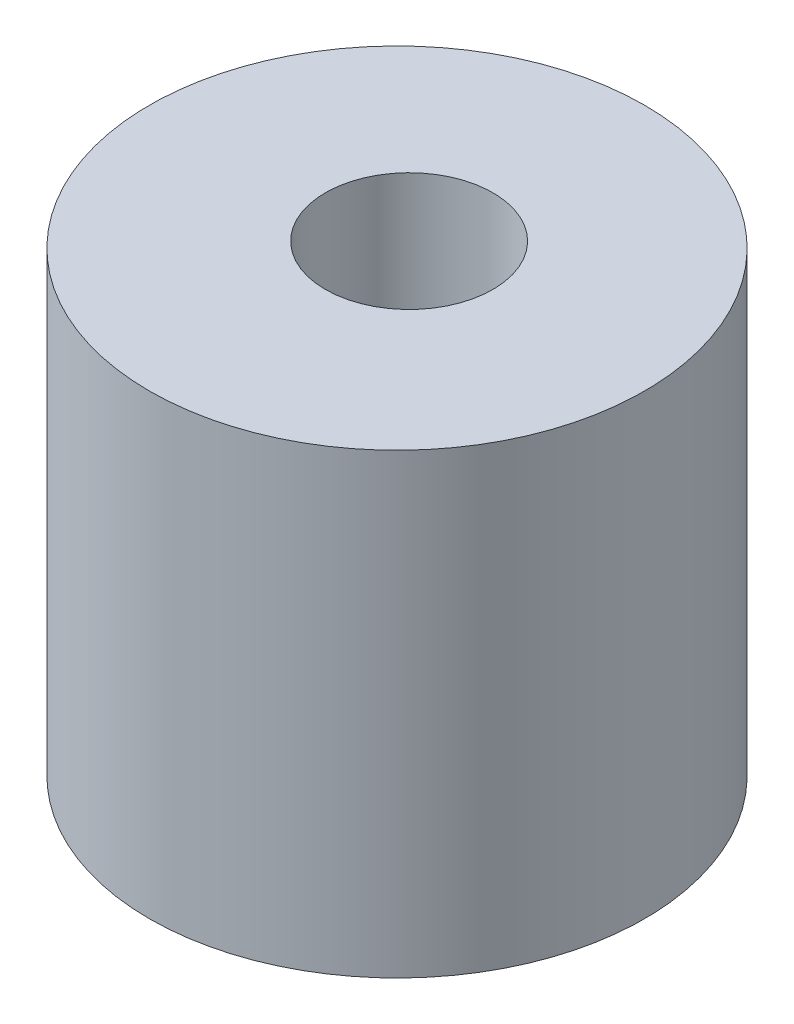
ISO-10303-21;
HEADER;
FILE_DESCRIPTION(('STEP AP214'),'2;1');
FILE_NAME('part.step','',(''),(''),'','','');
FILE_SCHEMA(('AUTOMOTIVE_DESIGN { 1 0 10303 214 1 1 1 1 }'));
ENDSEC;
DATA;
#1=APPLICATION_CONTEXT('core data for automotive mechanical design processes');
#2=APPLICATION_PROTOCOL_DEFINITION('international standard','automotive_design',2000,#1);
#3=PRODUCT_CONTEXT('',#1,'mechanical');
#4=PRODUCT('Part','Part','',(#3));
#5=PRODUCT_RELATED_PRODUCT_CATEGORY('part','',(#4));
#6=PRODUCT_DEFINITION_FORMATION('','',#4);
#7=PRODUCT_DEFINITION_CONTEXT('part definition',#1,'design');
#8=PRODUCT_DEFINITION('design','',#6,#7);
#9=PRODUCT_DEFINITION_SHAPE('','',#8);
#10=(LENGTH_UNIT() NAMED_UNIT(*) SI_UNIT(.MILLI.,.METRE.));
#11=(NAMED_UNIT(*) PLANE_ANGLE_UNIT() SI_UNIT($,.RADIAN.));
#12=(NAMED_UNIT(*) SI_UNIT($,.STERADIAN.) SOLID_ANGLE_UNIT());
#13=UNCERTAINTY_MEASURE_WITH_UNIT(LENGTH_MEASURE(1.E-05),#10,'distance_accuracy_value','');
#14=(GEOMETRIC_REPRESENTATION_CONTEXT(3) GLOBAL_UNCERTAINTY_ASSIGNED_CONTEXT((#13)) GLOBAL_UNIT_ASSIGNED_CONTEXT((#10,
#11,#12)) REPRESENTATION_CONTEXT('',''));
#15=CARTESIAN_POINT('',(0.,0.,0.));
#16=DIRECTION('',(0.,0.,1.));
#17=DIRECTION('',(1.,0.,0.));
#18=AXIS2_PLACEMENT_3D('',#15,#16,#17);
#19=CARTESIAN_POINT('',(0.,6.,0.));
#20=DIRECTION('',(0.,1.,0.));
#21=DIRECTION('',(0.,0.,1.));
#22=AXIS2_PLACEMENT_3D('',#19,#20,#21);
#23=PLANE('',#22);
#24=CARTESIAN_POINT('',(0.,6.,0.));
#25=DIRECTION('',(0.,1.,0.));
#26=DIRECTION('',(0.,0.,1.));
#27=AXIS2_PLACEMENT_3D('',#24,#25,#26);
#28=CIRCLE('',#27,3.25);
#29=CARTESIAN_POINT('',(0.,6.,3.25));
#30=VERTEX_POINT('',#29);
#31=EDGE_CURVE('E10',#30,#30,#28,.T.);
#32=ORIENTED_EDGE('',*,*,#31,.T.);
#33=EDGE_LOOP('',(#32));
#34=FACE_BOUND('',#33,.T.);
#35=CARTESIAN_POINT('',(0.,6.,-0.159304864094963));
#36=DIRECTION('',(0.,1.,0.));
#37=DIRECTION('',(0.,0.,1.));
#38=AXIS2_PLACEMENT_3D('',#35,#36,#37);
#39=CIRCLE('',#38,1.1);
#40=CARTESIAN_POINT('',(0.,6.,0.940695135905037));
#41=VERTEX_POINT('',#40);
#42=EDGE_CURVE('E50',#41,#41,#39,.T.);
#43=ORIENTED_EDGE('',*,*,#42,.F.);
#44=EDGE_LOOP('',(#43));
#45=FACE_BOUND('',#44,.T.);
#46=ADVANCED_FACE('F37',(#34,#45),#23,.T.);
#47=CARTESIAN_POINT('',(0.,0.,0.));
#48=DIRECTION('',(0.,1.,0.));
#49=DIRECTION('',(0.,0.,1.));
#50=AXIS2_PLACEMENT_3D('',#47,#48,#49);
#51=PLANE('',#50);
#52=CARTESIAN_POINT('',(0.,0.,0.));
#53=DIRECTION('',(0.,1.,0.));
#54=DIRECTION('',(0.,0.,1.));
#55=AXIS2_PLACEMENT_3D('',#52,#53,#54);
#56=CIRCLE('',#55,3.25);
#57=CARTESIAN_POINT('',(0.,0.,3.25));
#58=VERTEX_POINT('',#57);
#59=EDGE_CURVE('E41',#58,#58,#56,.T.);
#60=ORIENTED_EDGE('',*,*,#59,.F.);
#61=EDGE_LOOP('',(#60));
#62=FACE_BOUND('',#61,.T.);
#63=CARTESIAN_POINT('',(0.,0.,-0.159304864094963));
#64=DIRECTION('',(0.,1.,0.));
#65=DIRECTION('',(0.,0.,1.));
#66=AXIS2_PLACEMENT_3D('',#63,#64,#65);
#67=CIRCLE('',#66,1.1);
#68=CARTESIAN_POINT('',(0.,0.,0.940695135905037));
#69=VERTEX_POINT('',#68);
#70=EDGE_CURVE('E52',#69,#69,#67,.T.);
#71=ORIENTED_EDGE('',*,*,#70,.T.);
#72=EDGE_LOOP('',(#71));
#73=FACE_BOUND('',#72,.T.);
#74=ADVANCED_FACE('F64',(#62,#73),#51,.F.);
#75=CARTESIAN_POINT('',(0.,6.,0.));
#76=DIRECTION('',(0.,-1.,0.));
#77=DIRECTION('',(0.,0.,-1.));
#78=AXIS2_PLACEMENT_3D('',#75,#76,#77);
#79=CYLINDRICAL_SURFACE('',#78,3.25);
#80=ORIENTED_EDGE('',*,*,#31,.F.);
#81=EDGE_LOOP('',(#80));
#82=FACE_BOUND('',#81,.T.);
#83=ORIENTED_EDGE('',*,*,#59,.T.);
#84=EDGE_LOOP('',(#83));
#85=FACE_BOUND('',#84,.T.);
#86=ADVANCED_FACE('F39',(#82,#85),#79,.T.);
#87=CARTESIAN_POINT('',(0.,6.,-0.159304864094963));
#88=DIRECTION('',(0.,-1.,0.));
#89=DIRECTION('',(0.,0.,-1.));
#90=AXIS2_PLACEMENT_3D('',#87,#88,#89);
#91=CYLINDRICAL_SURFACE('',#90,1.1);
#92=ORIENTED_EDGE('',*,*,#42,.T.);
#93=EDGE_LOOP('',(#92));
#94=FACE_BOUND('',#93,.T.);
#95=ORIENTED_EDGE('',*,*,#70,.F.);
#96=EDGE_LOOP('',(#95));
#97=FACE_BOUND('',#96,.T.);
#98=ADVANCED_FACE('F60',(#94,#97),#91,.F.);
#99=CLOSED_SHELL('',(#46,#74,#86,#98));
#100=MANIFOLD_SOLID_BREP('B2',#99);
#101=ADVANCED_BREP_SHAPE_REPRESENTATION('',(#18,#100),#14);
#102=SHAPE_DEFINITION_REPRESENTATION(#9,#101);
ENDSEC;
END-ISO-10303-21;
